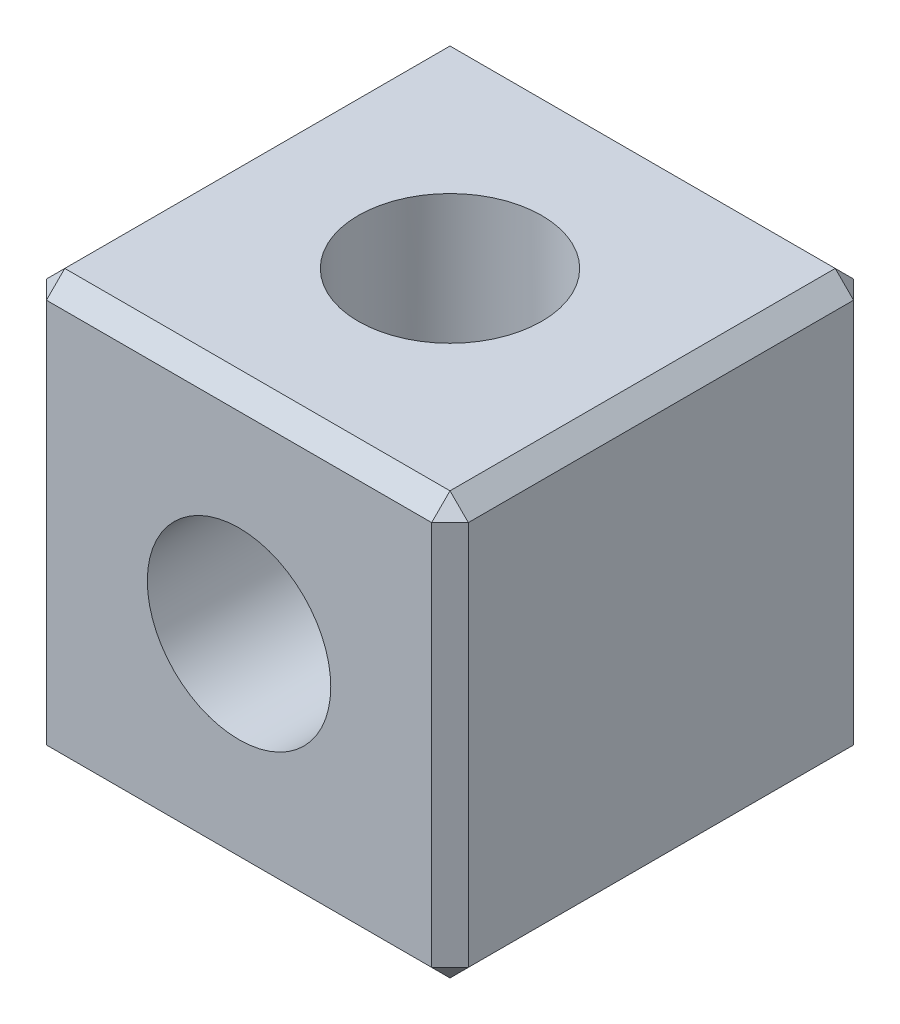
ISO-10303-21;
HEADER;
FILE_DESCRIPTION(('STEP AP214'),'2;1');
FILE_NAME('part.step','',(''),(''),'','','');
FILE_SCHEMA(('AUTOMOTIVE_DESIGN { 1 0 10303 214 1 1 1 1 }'));
ENDSEC;
DATA;
#1=APPLICATION_CONTEXT('core data for automotive mechanical design processes');
#2=APPLICATION_PROTOCOL_DEFINITION('international standard','automotive_design',2000,#1);
#3=PRODUCT_CONTEXT('',#1,'mechanical');
#4=PRODUCT('Part','Part','',(#3));
#5=PRODUCT_RELATED_PRODUCT_CATEGORY('part','',(#4));
#6=PRODUCT_DEFINITION_FORMATION('','',#4);
#7=PRODUCT_DEFINITION_CONTEXT('part definition',#1,'design');
#8=PRODUCT_DEFINITION('design','',#6,#7);
#9=PRODUCT_DEFINITION_SHAPE('','',#8);
#10=(LENGTH_UNIT() NAMED_UNIT(*) SI_UNIT(.MILLI.,.METRE.));
#11=(NAMED_UNIT(*) PLANE_ANGLE_UNIT() SI_UNIT($,.RADIAN.));
#12=(NAMED_UNIT(*) SI_UNIT($,.STERADIAN.) SOLID_ANGLE_UNIT());
#13=UNCERTAINTY_MEASURE_WITH_UNIT(LENGTH_MEASURE(1.E-05),#10,'distance_accuracy_value','');
#14=(GEOMETRIC_REPRESENTATION_CONTEXT(3) GLOBAL_UNCERTAINTY_ASSIGNED_CONTEXT((#13)) GLOBAL_UNIT_ASSIGNED_CONTEXT((#10,
#11,#12)) REPRESENTATION_CONTEXT('',''));
#15=CARTESIAN_POINT('',(0.,0.,0.));
#16=DIRECTION('',(0.,0.,1.));
#17=DIRECTION('',(1.,0.,0.));
#18=AXIS2_PLACEMENT_3D('',#15,#16,#17);
#19=CARTESIAN_POINT('',(0.,0.,0.));
#20=DIRECTION('',(0.,0.,1.));
#21=DIRECTION('',(1.,0.,0.));
#22=AXIS2_PLACEMENT_3D('',#19,#20,#21);
#23=CYLINDRICAL_SURFACE('',#22,5.);
#24=CARTESIAN_POINT('',(0.,0.,23.));
#25=DIRECTION('',(0.,0.,1.));
#26=DIRECTION('',(1.,0.,0.));
#27=AXIS2_PLACEMENT_3D('',#24,#25,#26);
#28=CIRCLE('',#27,5.);
#29=CARTESIAN_POINT('',(5.,0.,23.));
#30=VERTEX_POINT('',#29);
#31=EDGE_CURVE('E277',#30,#30,#28,.T.);
#32=ORIENTED_EDGE('',*,*,#31,.T.);
#33=EDGE_LOOP('',(#32));
#34=FACE_BOUND('',#33,.T.);
#35=CARTESIAN_POINT('',(0.,0.,11.5));
#36=DIRECTION('',(0.,-0.707106781186547,0.707106781186547));
#37=DIRECTION('',(0.,0.707106781186547,0.707106781186547));
#38=AXIS2_PLACEMENT_3D('',#35,#36,#37);
#39=ELLIPSE('',#38,7.07106781186548,5.);
#40=CARTESIAN_POINT('',(-5.,0.,11.5));
#41=VERTEX_POINT('',#40);
#42=CARTESIAN_POINT('',(5.,0.,11.5));
#43=VERTEX_POINT('',#42);
#44=EDGE_CURVE('E138',#41,#43,#39,.F.);
#45=ORIENTED_EDGE('',*,*,#44,.T.);
#46=CARTESIAN_POINT('',(0.,0.,11.5));
#47=DIRECTION('',(0.,0.707106781186547,0.707106781186547));
#48=DIRECTION('',(0.,-0.707106781186547,0.707106781186547));
#49=AXIS2_PLACEMENT_3D('',#46,#47,#48);
#50=ELLIPSE('',#49,7.07106781186548,5.);
#51=EDGE_CURVE('E134',#43,#41,#50,.F.);
#52=ORIENTED_EDGE('',*,*,#51,.T.);
#53=EDGE_LOOP('',(#45,#52));
#54=FACE_BOUND('',#53,.T.);
#55=ADVANCED_FACE('F32',(#34,#54),#23,.F.);
#56=CARTESIAN_POINT('',(11.5,-11.5,23.));
#57=DIRECTION('',(-1.,0.,0.));
#58=DIRECTION('',(0.,0.,1.));
#59=AXIS2_PLACEMENT_3D('',#56,#57,#58);
#60=PLANE('',#59);
#61=DIRECTION('',(0.,-1.,0.));
#62=VECTOR('',#61,1.);
#63=CARTESIAN_POINT('',(11.5,-11.5,22.));
#64=LINE('',#63,#62);
#65=CARTESIAN_POINT('',(11.5,10.5,22.));
#66=VERTEX_POINT('',#65);
#67=CARTESIAN_POINT('',(11.5,-10.5,22.));
#68=VERTEX_POINT('',#67);
#69=EDGE_CURVE('E191',#66,#68,#64,.T.);
#70=ORIENTED_EDGE('',*,*,#69,.T.);
#71=DIRECTION('',(0.,0.,-1.));
#72=VECTOR('',#71,1.);
#73=CARTESIAN_POINT('',(11.5,-10.5,23.));
#74=LINE('',#73,#72);
#75=CARTESIAN_POINT('',(11.5,-10.5,1.));
#76=VERTEX_POINT('',#75);
#77=EDGE_CURVE('E194',#68,#76,#74,.T.);
#78=ORIENTED_EDGE('',*,*,#77,.T.);
#79=DIRECTION('',(0.,1.,0.));
#80=VECTOR('',#79,1.);
#81=CARTESIAN_POINT('',(11.5,11.5,1.));
#82=LINE('',#81,#80);
#83=CARTESIAN_POINT('',(11.5,10.5,1.));
#84=VERTEX_POINT('',#83);
#85=EDGE_CURVE('E189',#76,#84,#82,.T.);
#86=ORIENTED_EDGE('',*,*,#85,.T.);
#87=DIRECTION('',(0.,0.,1.));
#88=VECTOR('',#87,1.);
#89=CARTESIAN_POINT('',(11.5,10.5,23.));
#90=LINE('',#89,#88);
#91=EDGE_CURVE('E187',#84,#66,#90,.T.);
#92=ORIENTED_EDGE('',*,*,#91,.T.);
#93=EDGE_LOOP('',(#70,#78,#86,#92));
#94=FACE_BOUND('',#93,.T.);
#95=ADVANCED_FACE('F302',(#94),#60,.F.);
#96=CARTESIAN_POINT('',(-11.5,11.5,23.));
#97=DIRECTION('',(0.,-1.,0.));
#98=DIRECTION('',(0.,0.,-1.));
#99=AXIS2_PLACEMENT_3D('',#96,#97,#98);
#100=PLANE('',#99);
#101=DIRECTION('',(-1.,0.,0.));
#102=VECTOR('',#101,1.);
#103=CARTESIAN_POINT('',(-11.5,11.5,1.));
#104=LINE('',#103,#102);
#105=CARTESIAN_POINT('',(10.5,11.5,1.));
#106=VERTEX_POINT('',#105);
#107=CARTESIAN_POINT('',(-10.5,11.5,1.));
#108=VERTEX_POINT('',#107);
#109=EDGE_CURVE('E160',#106,#108,#104,.T.);
#110=ORIENTED_EDGE('',*,*,#109,.T.);
#111=DIRECTION('',(0.,0.,1.));
#112=VECTOR('',#111,1.);
#113=CARTESIAN_POINT('',(-10.5,11.5,23.));
#114=LINE('',#113,#112);
#115=CARTESIAN_POINT('',(-10.5,11.5,22.));
#116=VERTEX_POINT('',#115);
#117=EDGE_CURVE('E166',#108,#116,#114,.T.);
#118=ORIENTED_EDGE('',*,*,#117,.T.);
#119=DIRECTION('',(1.,0.,0.));
#120=VECTOR('',#119,1.);
#121=CARTESIAN_POINT('',(-11.5,11.5,22.));
#122=LINE('',#121,#120);
#123=CARTESIAN_POINT('',(10.5,11.5,22.));
#124=VERTEX_POINT('',#123);
#125=EDGE_CURVE('E164',#116,#124,#122,.T.);
#126=ORIENTED_EDGE('',*,*,#125,.T.);
#127=DIRECTION('',(0.,0.,-1.));
#128=VECTOR('',#127,1.);
#129=CARTESIAN_POINT('',(10.5,11.5,23.));
#130=LINE('',#129,#128);
#131=EDGE_CURVE('E162',#124,#106,#130,.T.);
#132=ORIENTED_EDGE('',*,*,#131,.T.);
#133=EDGE_LOOP('',(#110,#118,#126,#132));
#134=FACE_BOUND('',#133,.T.);
#135=CARTESIAN_POINT('',(0.,11.5,11.5));
#136=DIRECTION('',(0.,1.,0.));
#137=DIRECTION('',(0.,0.,1.));
#138=AXIS2_PLACEMENT_3D('',#135,#136,#137);
#139=CIRCLE('',#138,5.);
#140=CARTESIAN_POINT('',(0.,11.5,16.5));
#141=VERTEX_POINT('',#140);
#142=EDGE_CURVE('E265',#141,#141,#139,.T.);
#143=ORIENTED_EDGE('',*,*,#142,.F.);
#144=EDGE_LOOP('',(#143));
#145=FACE_BOUND('',#144,.T.);
#146=ADVANCED_FACE('F306',(#134,#145),#100,.F.);
#147=CARTESIAN_POINT('',(-11.5,-11.5,23.));
#148=DIRECTION('',(1.,0.,0.));
#149=DIRECTION('',(0.,0.,-1.));
#150=AXIS2_PLACEMENT_3D('',#147,#148,#149);
#151=PLANE('',#150);
#152=DIRECTION('',(0.,1.,0.));
#153=VECTOR('',#152,1.);
#154=CARTESIAN_POINT('',(-11.5,-11.5,22.));
#155=LINE('',#154,#153);
#156=CARTESIAN_POINT('',(-11.5,-10.5,22.));
#157=VERTEX_POINT('',#156);
#158=CARTESIAN_POINT('',(-11.5,10.5,22.));
#159=VERTEX_POINT('',#158);
#160=EDGE_CURVE('E146',#157,#159,#155,.T.);
#161=ORIENTED_EDGE('',*,*,#160,.T.);
#162=DIRECTION('',(0.,0.,-1.));
#163=VECTOR('',#162,1.);
#164=CARTESIAN_POINT('',(-11.5,10.5,23.));
#165=LINE('',#164,#163);
#166=CARTESIAN_POINT('',(-11.5,10.5,1.));
#167=VERTEX_POINT('',#166);
#168=EDGE_CURVE('E157',#159,#167,#165,.T.);
#169=ORIENTED_EDGE('',*,*,#168,.T.);
#170=DIRECTION('',(0.,-1.,0.));
#171=VECTOR('',#170,1.);
#172=CARTESIAN_POINT('',(-11.5,-11.5,1.));
#173=LINE('',#172,#171);
#174=CARTESIAN_POINT('',(-11.5,-10.5,1.));
#175=VERTEX_POINT('',#174);
#176=EDGE_CURVE('E155',#167,#175,#173,.T.);
#177=ORIENTED_EDGE('',*,*,#176,.T.);
#178=DIRECTION('',(0.,0.,1.));
#179=VECTOR('',#178,1.);
#180=CARTESIAN_POINT('',(-11.5,-10.5,23.));
#181=LINE('',#180,#179);
#182=EDGE_CURVE('E153',#175,#157,#181,.T.);
#183=ORIENTED_EDGE('',*,*,#182,.T.);
#184=EDGE_LOOP('',(#161,#169,#177,#183));
#185=FACE_BOUND('',#184,.T.);
#186=ADVANCED_FACE('F298',(#185),#151,.F.);
#187=CARTESIAN_POINT('',(-11.5,-11.5,23.));
#188=DIRECTION('',(0.,1.,0.));
#189=DIRECTION('',(0.,0.,1.));
#190=AXIS2_PLACEMENT_3D('',#187,#188,#189);
#191=PLANE('',#190);
#192=DIRECTION('',(0.,0.,-1.));
#193=VECTOR('',#192,1.);
#194=CARTESIAN_POINT('',(-10.5,-11.5,23.));
#195=LINE('',#194,#193);
#196=CARTESIAN_POINT('',(-10.5,-11.5,22.));
#197=VERTEX_POINT('',#196);
#198=CARTESIAN_POINT('',(-10.5,-11.5,1.));
#199=VERTEX_POINT('',#198);
#200=EDGE_CURVE('E56',#197,#199,#195,.T.);
#201=ORIENTED_EDGE('',*,*,#200,.T.);
#202=DIRECTION('',(1.,0.,0.));
#203=VECTOR('',#202,1.);
#204=CARTESIAN_POINT('',(11.5,-11.5,1.));
#205=LINE('',#204,#203);
#206=CARTESIAN_POINT('',(10.5,-11.5,1.));
#207=VERTEX_POINT('',#206);
#208=EDGE_CURVE('E11',#199,#207,#205,.T.);
#209=ORIENTED_EDGE('',*,*,#208,.T.);
#210=DIRECTION('',(0.,0.,1.));
#211=VECTOR('',#210,1.);
#212=CARTESIAN_POINT('',(10.5,-11.5,23.));
#213=LINE('',#212,#211);
#214=CARTESIAN_POINT('',(10.5,-11.5,22.));
#215=VERTEX_POINT('',#214);
#216=EDGE_CURVE('E41',#207,#215,#213,.T.);
#217=ORIENTED_EDGE('',*,*,#216,.T.);
#218=DIRECTION('',(-1.,0.,0.));
#219=VECTOR('',#218,1.);
#220=CARTESIAN_POINT('',(-11.5,-11.5,22.));
#221=LINE('',#220,#219);
#222=EDGE_CURVE('E196',#215,#197,#221,.T.);
#223=ORIENTED_EDGE('',*,*,#222,.T.);
#224=EDGE_LOOP('',(#201,#209,#217,#223));
#225=FACE_BOUND('',#224,.T.);
#226=CARTESIAN_POINT('',(0.,-11.5,11.5));
#227=DIRECTION('',(0.,1.,0.));
#228=DIRECTION('',(0.,0.,1.));
#229=AXIS2_PLACEMENT_3D('',#226,#227,#228);
#230=CIRCLE('',#229,5.);
#231=CARTESIAN_POINT('',(0.,-11.5,16.5));
#232=VERTEX_POINT('',#231);
#233=EDGE_CURVE('E272',#232,#232,#230,.T.);
#234=ORIENTED_EDGE('',*,*,#233,.T.);
#235=EDGE_LOOP('',(#234));
#236=FACE_BOUND('',#235,.T.);
#237=ADVANCED_FACE('F289',(#225,#236),#191,.F.);
#238=CARTESIAN_POINT('',(0.,0.,23.));
#239=DIRECTION('',(0.,0.,-1.));
#240=DIRECTION('',(-1.,0.,0.));
#241=AXIS2_PLACEMENT_3D('',#238,#239,#240);
#242=PLANE('',#241);
#243=DIRECTION('',(1.,0.,0.));
#244=VECTOR('',#243,1.);
#245=CARTESIAN_POINT('',(0.,-10.5,23.));
#246=LINE('',#245,#244);
#247=CARTESIAN_POINT('',(-10.5,-10.5,23.));
#248=VERTEX_POINT('',#247);
#249=CARTESIAN_POINT('',(10.5,-10.5,23.));
#250=VERTEX_POINT('',#249);
#251=EDGE_CURVE('E182',#248,#250,#246,.T.);
#252=ORIENTED_EDGE('',*,*,#251,.T.);
#253=DIRECTION('',(0.,1.,0.));
#254=VECTOR('',#253,1.);
#255=CARTESIAN_POINT('',(10.5,0.,23.));
#256=LINE('',#255,#254);
#257=CARTESIAN_POINT('',(10.5,10.5,23.));
#258=VERTEX_POINT('',#257);
#259=EDGE_CURVE('E184',#250,#258,#256,.T.);
#260=ORIENTED_EDGE('',*,*,#259,.T.);
#261=DIRECTION('',(-1.,0.,0.));
#262=VECTOR('',#261,1.);
#263=CARTESIAN_POINT('',(0.,10.5,23.));
#264=LINE('',#263,#262);
#265=CARTESIAN_POINT('',(-10.5,10.5,23.));
#266=VERTEX_POINT('',#265);
#267=EDGE_CURVE('E178',#258,#266,#264,.T.);
#268=ORIENTED_EDGE('',*,*,#267,.T.);
#269=DIRECTION('',(0.,-1.,0.));
#270=VECTOR('',#269,1.);
#271=CARTESIAN_POINT('',(-10.5,0.,23.));
#272=LINE('',#271,#270);
#273=EDGE_CURVE('E180',#266,#248,#272,.T.);
#274=ORIENTED_EDGE('',*,*,#273,.T.);
#275=EDGE_LOOP('',(#252,#260,#268,#274));
#276=FACE_BOUND('',#275,.T.);
#277=ORIENTED_EDGE('',*,*,#31,.F.);
#278=EDGE_LOOP('',(#277));
#279=FACE_BOUND('',#278,.T.);
#280=ADVANCED_FACE('F286',(#276,#279),#242,.F.);
#281=CARTESIAN_POINT('',(0.,0.,0.));
#282=DIRECTION('',(0.,0.,-1.));
#283=DIRECTION('',(-1.,0.,0.));
#284=AXIS2_PLACEMENT_3D('',#281,#282,#283);
#285=PLANE('',#284);
#286=DIRECTION('',(0.,-1.,0.));
#287=VECTOR('',#286,1.);
#288=CARTESIAN_POINT('',(10.5,-11.5,0.));
#289=LINE('',#288,#287);
#290=CARTESIAN_POINT('',(10.5,10.5,0.));
#291=VERTEX_POINT('',#290);
#292=CARTESIAN_POINT('',(10.5,-10.5,0.));
#293=VERTEX_POINT('',#292);
#294=EDGE_CURVE('E171',#291,#293,#289,.T.);
#295=ORIENTED_EDGE('',*,*,#294,.T.);
#296=DIRECTION('',(-1.,0.,0.));
#297=VECTOR('',#296,1.);
#298=CARTESIAN_POINT('',(-11.5,-10.5,0.));
#299=LINE('',#298,#297);
#300=CARTESIAN_POINT('',(-10.5,-10.5,0.));
#301=VERTEX_POINT('',#300);
#302=EDGE_CURVE('E176',#293,#301,#299,.T.);
#303=ORIENTED_EDGE('',*,*,#302,.T.);
#304=DIRECTION('',(0.,1.,0.));
#305=VECTOR('',#304,1.);
#306=CARTESIAN_POINT('',(-10.5,11.5,0.));
#307=LINE('',#306,#305);
#308=CARTESIAN_POINT('',(-10.5,10.5,0.));
#309=VERTEX_POINT('',#308);
#310=EDGE_CURVE('E173',#301,#309,#307,.T.);
#311=ORIENTED_EDGE('',*,*,#310,.T.);
#312=DIRECTION('',(1.,0.,0.));
#313=VECTOR('',#312,1.);
#314=CARTESIAN_POINT('',(11.5,10.5,0.));
#315=LINE('',#314,#313);
#316=EDGE_CURVE('E169',#309,#291,#315,.T.);
#317=ORIENTED_EDGE('',*,*,#316,.T.);
#318=EDGE_LOOP('',(#295,#303,#311,#317));
#319=FACE_BOUND('',#318,.T.);
#320=CARTESIAN_POINT('',(0.,0.,0.));
#321=DIRECTION('',(0.,0.,1.));
#322=DIRECTION('',(1.,0.,0.));
#323=AXIS2_PLACEMENT_3D('',#320,#321,#322);
#324=CIRCLE('',#323,5.);
#325=CARTESIAN_POINT('',(5.,0.,0.));
#326=VERTEX_POINT('',#325);
#327=EDGE_CURVE('E144',#326,#326,#324,.T.);
#328=ORIENTED_EDGE('',*,*,#327,.T.);
#329=EDGE_LOOP('',(#328));
#330=FACE_BOUND('',#329,.T.);
#331=ADVANCED_FACE('F288',(#319,#330),#285,.T.);
#332=CARTESIAN_POINT('',(0.,0.,11.5));
#333=DIRECTION('',(0.,-0.707106781186547,0.707106781186547));
#334=DIRECTION('',(0.,0.707106781186547,0.707106781186547));
#335=AXIS2_PLACEMENT_3D('',#332,#333,#334);
#336=ELLIPSE('',#335,7.07106781186548,5.);
#337=EDGE_CURVE('E130',#41,#43,#336,.T.);
#338=ORIENTED_EDGE('',*,*,#337,.T.);
#339=CARTESIAN_POINT('',(0.,0.,11.5));
#340=DIRECTION('',(0.,0.707106781186547,0.707106781186547));
#341=DIRECTION('',(0.,-0.707106781186547,0.707106781186547));
#342=AXIS2_PLACEMENT_3D('',#339,#340,#341);
#343=ELLIPSE('',#342,7.07106781186548,5.);
#344=EDGE_CURVE('E137',#43,#41,#343,.T.);
#345=ORIENTED_EDGE('',*,*,#344,.T.);
#346=EDGE_LOOP('',(#338,#345));
#347=FACE_BOUND('',#346,.T.);
#348=ORIENTED_EDGE('',*,*,#327,.F.);
#349=EDGE_LOOP('',(#348));
#350=FACE_BOUND('',#349,.T.);
#351=ADVANCED_FACE('F148',(#347,#350),#23,.F.);
#352=CARTESIAN_POINT('',(0.,-11.5,11.5));
#353=DIRECTION('',(0.,1.,0.));
#354=DIRECTION('',(0.,0.,1.));
#355=AXIS2_PLACEMENT_3D('',#352,#353,#354);
#356=CYLINDRICAL_SURFACE('',#355,5.);
#357=ORIENTED_EDGE('',*,*,#142,.T.);
#358=EDGE_LOOP('',(#357));
#359=FACE_BOUND('',#358,.T.);
#360=ORIENTED_EDGE('',*,*,#44,.F.);
#361=ORIENTED_EDGE('',*,*,#344,.F.);
#362=EDGE_LOOP('',(#360,#361));
#363=FACE_BOUND('',#362,.T.);
#364=ADVANCED_FACE('F142',(#359,#363),#356,.F.);
#365=ORIENTED_EDGE('',*,*,#233,.F.);
#366=EDGE_LOOP('',(#365));
#367=FACE_BOUND('',#366,.T.);
#368=ORIENTED_EDGE('',*,*,#337,.F.);
#369=ORIENTED_EDGE('',*,*,#51,.F.);
#370=EDGE_LOOP('',(#368,#369));
#371=FACE_BOUND('',#370,.T.);
#372=ADVANCED_FACE('F132',(#367,#371),#356,.F.);
#373=CARTESIAN_POINT('',(11.5,-10.5,23.));
#374=DIRECTION('',(-0.707106781186546,0.707106781186549,0.));
#375=DIRECTION('',(0.,0.,-1.));
#376=AXIS2_PLACEMENT_3D('',#373,#374,#375);
#377=PLANE('',#376);
#378=DIRECTION('',(-0.707106781186549,-0.707106781186546,0.));
#379=VECTOR('',#378,1.);
#380=CARTESIAN_POINT('',(11.5,-10.5,22.));
#381=LINE('',#380,#379);
#382=EDGE_CURVE('E36',#215,#68,#381,.F.);
#383=ORIENTED_EDGE('',*,*,#382,.F.);
#384=ORIENTED_EDGE('',*,*,#216,.F.);
#385=DIRECTION('',(0.707106781186549,0.707106781186546,0.));
#386=VECTOR('',#385,1.);
#387=CARTESIAN_POINT('',(11.,-11.,1.));
#388=LINE('',#387,#386);
#389=EDGE_CURVE('E259',#76,#207,#388,.F.);
#390=ORIENTED_EDGE('',*,*,#389,.F.);
#391=ORIENTED_EDGE('',*,*,#77,.F.);
#392=EDGE_LOOP('',(#383,#384,#390,#391));
#393=FACE_BOUND('',#392,.T.);
#394=ADVANCED_FACE('F34',(#393),#377,.F.);
#395=CARTESIAN_POINT('',(11.5,-10.5,22.));
#396=DIRECTION('',(0.577350269189626,-0.577350269189628,0.577350269189624));
#397=DIRECTION('',(0.707106781186549,0.707106781186546,0.));
#398=AXIS2_PLACEMENT_3D('',#395,#396,#397);
#399=PLANE('',#398);
#400=DIRECTION('',(0.,0.707106781186546,0.707106781186549));
#401=VECTOR('',#400,1.);
#402=CARTESIAN_POINT('',(10.5,-11.,22.5));
#403=LINE('',#402,#401);
#404=EDGE_CURVE('E255',#215,#250,#403,.T.);
#405=ORIENTED_EDGE('',*,*,#404,.F.);
#406=ORIENTED_EDGE('',*,*,#382,.T.);
#407=DIRECTION('',(0.707106781186546,0.,-0.707106781186549));
#408=VECTOR('',#407,1.);
#409=CARTESIAN_POINT('',(11.5,-10.5,22.));
#410=LINE('',#409,#408);
#411=EDGE_CURVE('E258',#250,#68,#410,.T.);
#412=ORIENTED_EDGE('',*,*,#411,.F.);
#413=EDGE_LOOP('',(#405,#406,#412));
#414=FACE_BOUND('',#413,.T.);
#415=ADVANCED_FACE('F321',(#414),#399,.T.);
#416=CARTESIAN_POINT('',(10.5,-10.5,0.));
#417=DIRECTION('',(0.577350269189624,-0.577350269189626,-0.577350269189628));
#418=DIRECTION('',(0.,0.707106781186549,-0.707106781186546));
#419=AXIS2_PLACEMENT_3D('',#416,#417,#418);
#420=PLANE('',#419);
#421=DIRECTION('',(0.707106781186549,0.,0.707106781186546));
#422=VECTOR('',#421,1.);
#423=CARTESIAN_POINT('',(10.5,-10.5,0.));
#424=LINE('',#423,#422);
#425=EDGE_CURVE('E251',#76,#293,#424,.F.);
#426=ORIENTED_EDGE('',*,*,#425,.F.);
#427=ORIENTED_EDGE('',*,*,#389,.T.);
#428=DIRECTION('',(0.,0.707106781186549,-0.707106781186546));
#429=VECTOR('',#428,1.);
#430=CARTESIAN_POINT('',(10.5,-10.5,0.));
#431=LINE('',#430,#429);
#432=EDGE_CURVE('E49',#293,#207,#431,.F.);
#433=ORIENTED_EDGE('',*,*,#432,.F.);
#434=EDGE_LOOP('',(#426,#427,#433));
#435=FACE_BOUND('',#434,.T.);
#436=ADVANCED_FACE('F328',(#435),#420,.T.);
#437=CARTESIAN_POINT('',(10.5,0.,23.));
#438=DIRECTION('',(-0.707106781186549,0.,-0.707106781186546));
#439=DIRECTION('',(0.,1.,0.));
#440=AXIS2_PLACEMENT_3D('',#437,#438,#439);
#441=PLANE('',#440);
#442=ORIENTED_EDGE('',*,*,#411,.T.);
#443=ORIENTED_EDGE('',*,*,#69,.F.);
#444=DIRECTION('',(-0.707106781186546,0.,0.707106781186549));
#445=VECTOR('',#444,1.);
#446=CARTESIAN_POINT('',(10.5,10.5,23.));
#447=LINE('',#446,#445);
#448=EDGE_CURVE('E245',#258,#66,#447,.F.);
#449=ORIENTED_EDGE('',*,*,#448,.F.);
#450=ORIENTED_EDGE('',*,*,#259,.F.);
#451=EDGE_LOOP('',(#442,#443,#449,#450));
#452=FACE_BOUND('',#451,.T.);
#453=ADVANCED_FACE('F355',(#452),#441,.F.);
#454=CARTESIAN_POINT('',(0.,-10.5,23.));
#455=DIRECTION('',(0.,0.707106781186549,-0.707106781186546));
#456=DIRECTION('',(1.,0.,0.));
#457=AXIS2_PLACEMENT_3D('',#454,#455,#456);
#458=PLANE('',#457);
#459=ORIENTED_EDGE('',*,*,#404,.T.);
#460=ORIENTED_EDGE('',*,*,#251,.F.);
#461=DIRECTION('',(0.,-0.707106781186546,-0.707106781186549));
#462=VECTOR('',#461,1.);
#463=CARTESIAN_POINT('',(-10.5,-11.,22.5));
#464=LINE('',#463,#462);
#465=EDGE_CURVE('E242',#197,#248,#464,.F.);
#466=ORIENTED_EDGE('',*,*,#465,.F.);
#467=ORIENTED_EDGE('',*,*,#222,.F.);
#468=EDGE_LOOP('',(#459,#460,#466,#467));
#469=FACE_BOUND('',#468,.T.);
#470=ADVANCED_FACE('F334',(#469),#458,.F.);
#471=CARTESIAN_POINT('',(-10.5,-11.5,23.));
#472=DIRECTION('',(0.707106781186549,0.707106781186546,0.));
#473=DIRECTION('',(0.,0.,-1.));
#474=AXIS2_PLACEMENT_3D('',#471,#472,#473);
#475=PLANE('',#474);
#476=DIRECTION('',(0.707106781186546,-0.707106781186549,0.));
#477=VECTOR('',#476,1.);
#478=CARTESIAN_POINT('',(-11.5,-10.5,1.));
#479=LINE('',#478,#477);
#480=EDGE_CURVE('E236',#199,#175,#479,.F.);
#481=ORIENTED_EDGE('',*,*,#480,.F.);
#482=ORIENTED_EDGE('',*,*,#200,.F.);
#483=DIRECTION('',(-0.707106781186546,0.707106781186549,0.));
#484=VECTOR('',#483,1.);
#485=CARTESIAN_POINT('',(-11.5,-10.5,22.));
#486=LINE('',#485,#484);
#487=EDGE_CURVE('E239',#157,#197,#486,.F.);
#488=ORIENTED_EDGE('',*,*,#487,.F.);
#489=ORIENTED_EDGE('',*,*,#182,.F.);
#490=EDGE_LOOP('',(#481,#482,#488,#489));
#491=FACE_BOUND('',#490,.T.);
#492=ADVANCED_FACE('F338',(#491),#475,.F.);
#493=CARTESIAN_POINT('',(-11.5,-11.5,1.));
#494=DIRECTION('',(0.,-0.707106781186546,-0.707106781186549));
#495=DIRECTION('',(-1.,0.,0.));
#496=AXIS2_PLACEMENT_3D('',#493,#494,#495);
#497=PLANE('',#496);
#498=ORIENTED_EDGE('',*,*,#432,.T.);
#499=ORIENTED_EDGE('',*,*,#208,.F.);
#500=DIRECTION('',(0.,-0.707106781186549,0.707106781186546));
#501=VECTOR('',#500,1.);
#502=CARTESIAN_POINT('',(-10.5,-11.,0.500000000000001));
#503=LINE('',#502,#501);
#504=EDGE_CURVE('E233',#301,#199,#503,.T.);
#505=ORIENTED_EDGE('',*,*,#504,.F.);
#506=ORIENTED_EDGE('',*,*,#302,.F.);
#507=EDGE_LOOP('',(#498,#499,#505,#506));
#508=FACE_BOUND('',#507,.T.);
#509=ADVANCED_FACE('F346',(#508),#497,.T.);
#510=CARTESIAN_POINT('',(11.5,-11.5,1.));
#511=DIRECTION('',(0.707106781186546,0.,-0.707106781186549));
#512=DIRECTION('',(0.,-1.,0.));
#513=AXIS2_PLACEMENT_3D('',#510,#511,#512);
#514=PLANE('',#513);
#515=ORIENTED_EDGE('',*,*,#425,.T.);
#516=ORIENTED_EDGE('',*,*,#294,.F.);
#517=DIRECTION('',(-0.707106781186549,0.,-0.707106781186546));
#518=VECTOR('',#517,1.);
#519=CARTESIAN_POINT('',(11.5,10.5,1.));
#520=LINE('',#519,#518);
#521=EDGE_CURVE('E230',#84,#291,#520,.T.);
#522=ORIENTED_EDGE('',*,*,#521,.F.);
#523=ORIENTED_EDGE('',*,*,#85,.F.);
#524=EDGE_LOOP('',(#515,#516,#522,#523));
#525=FACE_BOUND('',#524,.T.);
#526=ADVANCED_FACE('F353',(#525),#514,.T.);
#527=CARTESIAN_POINT('',(10.5,11.5,23.));
#528=DIRECTION('',(-0.707106781186549,-0.707106781186546,0.));
#529=DIRECTION('',(0.,0.,-1.));
#530=AXIS2_PLACEMENT_3D('',#527,#528,#529);
#531=PLANE('',#530);
#532=DIRECTION('',(0.707106781186546,-0.707106781186549,0.));
#533=VECTOR('',#532,1.);
#534=CARTESIAN_POINT('',(11.,11.,22.));
#535=LINE('',#534,#533);
#536=EDGE_CURVE('E248',#66,#124,#535,.F.);
#537=ORIENTED_EDGE('',*,*,#536,.F.);
#538=ORIENTED_EDGE('',*,*,#91,.F.);
#539=DIRECTION('',(-0.707106781186546,0.707106781186549,0.));
#540=VECTOR('',#539,1.);
#541=CARTESIAN_POINT('',(11.5,10.5,1.));
#542=LINE('',#541,#540);
#543=EDGE_CURVE('E227',#106,#84,#542,.F.);
#544=ORIENTED_EDGE('',*,*,#543,.F.);
#545=ORIENTED_EDGE('',*,*,#131,.F.);
#546=EDGE_LOOP('',(#537,#538,#544,#545));
#547=FACE_BOUND('',#546,.T.);
#548=ADVANCED_FACE('F371',(#547),#531,.F.);
#549=CARTESIAN_POINT('',(10.5,10.5,23.));
#550=DIRECTION('',(0.577350269189628,0.577350269189624,0.577350269189626));
#551=DIRECTION('',(0.707106781186546,0.,-0.707106781186549));
#552=AXIS2_PLACEMENT_3D('',#549,#550,#551);
#553=PLANE('',#552);
#554=ORIENTED_EDGE('',*,*,#448,.T.);
#555=ORIENTED_EDGE('',*,*,#536,.T.);
#556=DIRECTION('',(0.,0.707106781186549,-0.707106781186546));
#557=VECTOR('',#556,1.);
#558=CARTESIAN_POINT('',(10.5,10.5,23.));
#559=LINE('',#558,#557);
#560=EDGE_CURVE('E224',#258,#124,#559,.T.);
#561=ORIENTED_EDGE('',*,*,#560,.F.);
#562=EDGE_LOOP('',(#554,#555,#561));
#563=FACE_BOUND('',#562,.T.);
#564=ADVANCED_FACE('F374',(#563),#553,.T.);
#565=CARTESIAN_POINT('',(-11.5,-10.5,22.));
#566=DIRECTION('',(-0.577350269189628,-0.577350269189626,0.577350269189624));
#567=DIRECTION('',(0.707106781186546,-0.707106781186549,0.));
#568=AXIS2_PLACEMENT_3D('',#565,#566,#567);
#569=PLANE('',#568);
#570=ORIENTED_EDGE('',*,*,#487,.T.);
#571=ORIENTED_EDGE('',*,*,#465,.T.);
#572=DIRECTION('',(0.707106781186546,0.,0.707106781186549));
#573=VECTOR('',#572,1.);
#574=CARTESIAN_POINT('',(-11.5,-10.5,22.));
#575=LINE('',#574,#573);
#576=EDGE_CURVE('E221',#157,#248,#575,.T.);
#577=ORIENTED_EDGE('',*,*,#576,.F.);
#578=EDGE_LOOP('',(#570,#571,#577));
#579=FACE_BOUND('',#578,.T.);
#580=ADVANCED_FACE('F378',(#579),#569,.T.);
#581=CARTESIAN_POINT('',(-11.5,-10.5,1.));
#582=DIRECTION('',(-0.577350269189626,-0.577350269189624,-0.577350269189628));
#583=DIRECTION('',(-0.707106781186549,0.,0.707106781186546));
#584=AXIS2_PLACEMENT_3D('',#581,#582,#583);
#585=PLANE('',#584);
#586=ORIENTED_EDGE('',*,*,#504,.T.);
#587=ORIENTED_EDGE('',*,*,#480,.T.);
#588=DIRECTION('',(0.707106781186549,0.,-0.707106781186546));
#589=VECTOR('',#588,1.);
#590=CARTESIAN_POINT('',(-11.5,-10.5,1.));
#591=LINE('',#590,#589);
#592=EDGE_CURVE('E218',#301,#175,#591,.F.);
#593=ORIENTED_EDGE('',*,*,#592,.F.);
#594=EDGE_LOOP('',(#586,#587,#593));
#595=FACE_BOUND('',#594,.T.);
#596=ADVANCED_FACE('F344',(#595),#585,.T.);
#597=CARTESIAN_POINT('',(11.5,10.5,1.));
#598=DIRECTION('',(0.577350269189626,0.577350269189624,-0.577350269189628));
#599=DIRECTION('',(-0.707106781186549,0.,-0.707106781186546));
#600=AXIS2_PLACEMENT_3D('',#597,#598,#599);
#601=PLANE('',#600);
#602=ORIENTED_EDGE('',*,*,#543,.T.);
#603=ORIENTED_EDGE('',*,*,#521,.T.);
#604=DIRECTION('',(0.,0.707106781186549,0.707106781186546));
#605=VECTOR('',#604,1.);
#606=CARTESIAN_POINT('',(10.5,11.,0.500000000000001));
#607=LINE('',#606,#605);
#608=EDGE_CURVE('E215',#106,#291,#607,.F.);
#609=ORIENTED_EDGE('',*,*,#608,.F.);
#610=EDGE_LOOP('',(#602,#603,#609));
#611=FACE_BOUND('',#610,.T.);
#612=ADVANCED_FACE('F385',(#611),#601,.T.);
#613=CARTESIAN_POINT('',(0.,10.5,23.));
#614=DIRECTION('',(0.,-0.707106781186546,-0.707106781186549));
#615=DIRECTION('',(-1.,0.,0.));
#616=AXIS2_PLACEMENT_3D('',#613,#614,#615);
#617=PLANE('',#616);
#618=ORIENTED_EDGE('',*,*,#560,.T.);
#619=ORIENTED_EDGE('',*,*,#125,.F.);
#620=DIRECTION('',(0.,-0.707106781186549,0.707106781186546));
#621=VECTOR('',#620,1.);
#622=CARTESIAN_POINT('',(-10.5,11.5,22.));
#623=LINE('',#622,#621);
#624=EDGE_CURVE('E212',#266,#116,#623,.F.);
#625=ORIENTED_EDGE('',*,*,#624,.F.);
#626=ORIENTED_EDGE('',*,*,#267,.F.);
#627=EDGE_LOOP('',(#618,#619,#625,#626));
#628=FACE_BOUND('',#627,.T.);
#629=ADVANCED_FACE('F388',(#628),#617,.F.);
#630=CARTESIAN_POINT('',(-10.5,0.,23.));
#631=DIRECTION('',(0.707106781186549,0.,-0.707106781186546));
#632=DIRECTION('',(0.,-1.,0.));
#633=AXIS2_PLACEMENT_3D('',#630,#631,#632);
#634=PLANE('',#633);
#635=ORIENTED_EDGE('',*,*,#576,.T.);
#636=ORIENTED_EDGE('',*,*,#273,.F.);
#637=DIRECTION('',(-0.707106781186546,0.,-0.707106781186549));
#638=VECTOR('',#637,1.);
#639=CARTESIAN_POINT('',(-11.,10.5,22.5));
#640=LINE('',#639,#638);
#641=EDGE_CURVE('E209',#159,#266,#640,.F.);
#642=ORIENTED_EDGE('',*,*,#641,.F.);
#643=ORIENTED_EDGE('',*,*,#160,.F.);
#644=EDGE_LOOP('',(#635,#636,#642,#643));
#645=FACE_BOUND('',#644,.T.);
#646=ADVANCED_FACE('F392',(#645),#634,.F.);
#647=CARTESIAN_POINT('',(-11.5,-11.5,1.));
#648=DIRECTION('',(-0.707106781186546,0.,-0.707106781186549));
#649=DIRECTION('',(0.,1.,0.));
#650=AXIS2_PLACEMENT_3D('',#647,#648,#649);
#651=PLANE('',#650);
#652=ORIENTED_EDGE('',*,*,#592,.T.);
#653=ORIENTED_EDGE('',*,*,#176,.F.);
#654=DIRECTION('',(-0.707106781186549,0.,0.707106781186546));
#655=VECTOR('',#654,1.);
#656=CARTESIAN_POINT('',(-11.5,10.5,1.));
#657=LINE('',#656,#655);
#658=EDGE_CURVE('E206',#309,#167,#657,.T.);
#659=ORIENTED_EDGE('',*,*,#658,.F.);
#660=ORIENTED_EDGE('',*,*,#310,.F.);
#661=EDGE_LOOP('',(#652,#653,#659,#660));
#662=FACE_BOUND('',#661,.T.);
#663=ADVANCED_FACE('F396',(#662),#651,.T.);
#664=CARTESIAN_POINT('',(-11.5,11.5,1.));
#665=DIRECTION('',(0.,0.707106781186546,-0.707106781186549));
#666=DIRECTION('',(1.,0.,0.));
#667=AXIS2_PLACEMENT_3D('',#664,#665,#666);
#668=PLANE('',#667);
#669=ORIENTED_EDGE('',*,*,#608,.T.);
#670=ORIENTED_EDGE('',*,*,#316,.F.);
#671=DIRECTION('',(0.,-0.707106781186549,-0.707106781186546));
#672=VECTOR('',#671,1.);
#673=CARTESIAN_POINT('',(-10.5,11.,0.500000000000001));
#674=LINE('',#673,#672);
#675=EDGE_CURVE('E204',#108,#309,#674,.T.);
#676=ORIENTED_EDGE('',*,*,#675,.F.);
#677=ORIENTED_EDGE('',*,*,#109,.F.);
#678=EDGE_LOOP('',(#669,#670,#676,#677));
#679=FACE_BOUND('',#678,.T.);
#680=ADVANCED_FACE('F400',(#679),#668,.T.);
#681=CARTESIAN_POINT('',(-10.5,11.5,22.));
#682=DIRECTION('',(-0.577350269189628,0.577350269189624,0.577350269189626));
#683=DIRECTION('',(0.707106781186546,0.,0.707106781186549));
#684=AXIS2_PLACEMENT_3D('',#681,#682,#683);
#685=PLANE('',#684);
#686=ORIENTED_EDGE('',*,*,#641,.T.);
#687=ORIENTED_EDGE('',*,*,#624,.T.);
#688=DIRECTION('',(0.707106781186546,0.707106781186549,0.));
#689=VECTOR('',#688,1.);
#690=CARTESIAN_POINT('',(-10.5,11.5,22.));
#691=LINE('',#690,#689);
#692=EDGE_CURVE('E202',#159,#116,#691,.T.);
#693=ORIENTED_EDGE('',*,*,#692,.F.);
#694=EDGE_LOOP('',(#686,#687,#693));
#695=FACE_BOUND('',#694,.T.);
#696=ADVANCED_FACE('F404',(#695),#685,.T.);
#697=CARTESIAN_POINT('',(-11.5,10.5,1.));
#698=DIRECTION('',(-0.577350269189626,0.577350269189624,-0.577350269189628));
#699=DIRECTION('',(-0.707106781186549,0.,0.707106781186546));
#700=AXIS2_PLACEMENT_3D('',#697,#698,#699);
#701=PLANE('',#700);
#702=ORIENTED_EDGE('',*,*,#675,.T.);
#703=ORIENTED_EDGE('',*,*,#658,.T.);
#704=DIRECTION('',(-0.707106781186546,-0.707106781186549,0.));
#705=VECTOR('',#704,1.);
#706=CARTESIAN_POINT('',(-11.5,10.5,1.));
#707=LINE('',#706,#705);
#708=EDGE_CURVE('E200',#108,#167,#707,.T.);
#709=ORIENTED_EDGE('',*,*,#708,.F.);
#710=EDGE_LOOP('',(#702,#703,#709));
#711=FACE_BOUND('',#710,.T.);
#712=ADVANCED_FACE('F408',(#711),#701,.T.);
#713=CARTESIAN_POINT('',(-11.5,10.5,23.));
#714=DIRECTION('',(0.707106781186549,-0.707106781186546,0.));
#715=DIRECTION('',(0.,0.,-1.));
#716=AXIS2_PLACEMENT_3D('',#713,#714,#715);
#717=PLANE('',#716);
#718=ORIENTED_EDGE('',*,*,#692,.T.);
#719=ORIENTED_EDGE('',*,*,#117,.F.);
#720=ORIENTED_EDGE('',*,*,#708,.T.);
#721=ORIENTED_EDGE('',*,*,#168,.F.);
#722=EDGE_LOOP('',(#718,#719,#720,#721));
#723=FACE_BOUND('',#722,.T.);
#724=ADVANCED_FACE('F412',(#723),#717,.F.);
#725=CLOSED_SHELL('',(#55,#95,#146,#186,#237,#280,#331,#351,#364,#372,#394,#415,#436,#453,#470,
#492,#509,#526,#548,#564,#580,#596,#612,#629,#646,#663,#680,#696,#712,#724));
#726=MANIFOLD_SOLID_BREP('B2',#725);
#727=ADVANCED_BREP_SHAPE_REPRESENTATION('',(#18,#726),#14);
#728=SHAPE_DEFINITION_REPRESENTATION(#9,#727);
ENDSEC;
END-ISO-10303-21;
